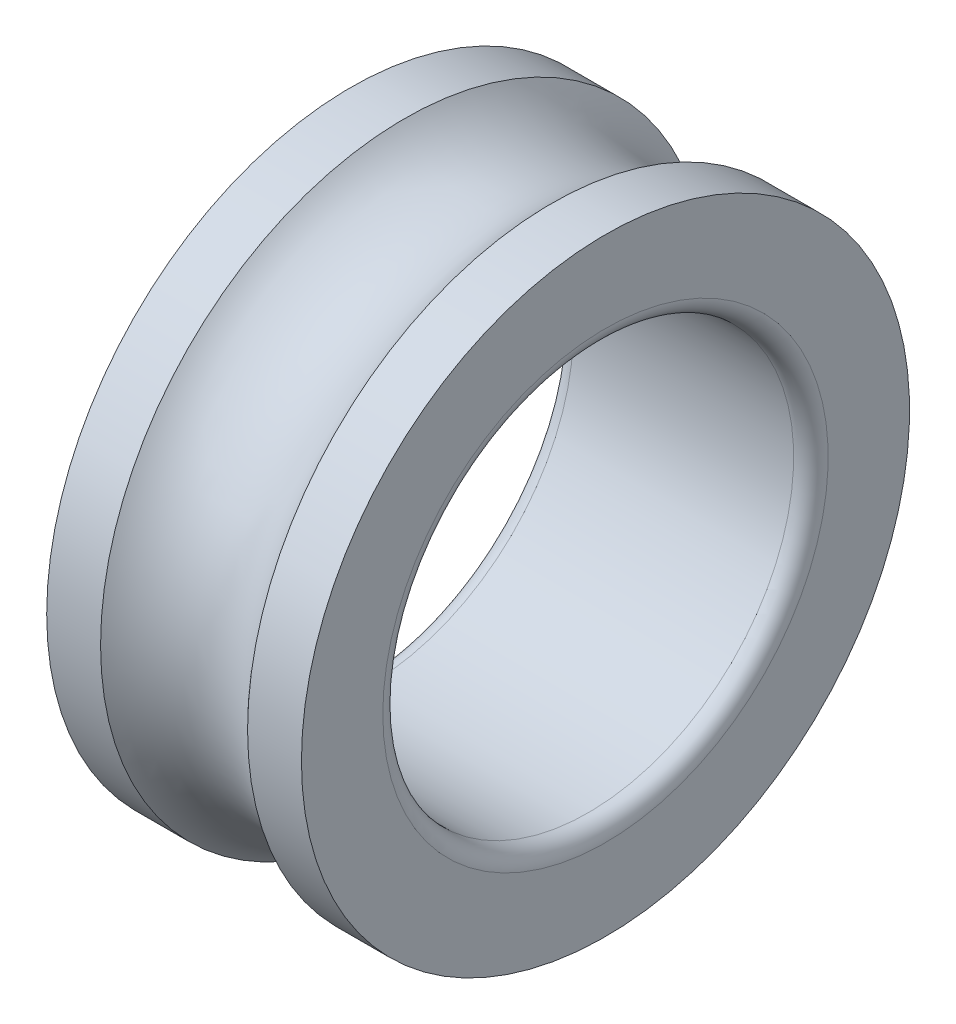
ISO-10303-21;
HEADER;
FILE_DESCRIPTION(('STEP AP214'),'2;1');
FILE_NAME('part.step','',(''),(''),'','','');
FILE_SCHEMA(('AUTOMOTIVE_DESIGN { 1 0 10303 214 1 1 1 1 }'));
ENDSEC;
DATA;
#1=APPLICATION_CONTEXT('core data for automotive mechanical design processes');
#2=APPLICATION_PROTOCOL_DEFINITION('international standard','automotive_design',2000,#1);
#3=PRODUCT_CONTEXT('',#1,'mechanical');
#4=PRODUCT('Part','Part','',(#3));
#5=PRODUCT_RELATED_PRODUCT_CATEGORY('part','',(#4));
#6=PRODUCT_DEFINITION_FORMATION('','',#4);
#7=PRODUCT_DEFINITION_CONTEXT('part definition',#1,'design');
#8=PRODUCT_DEFINITION('design','',#6,#7);
#9=PRODUCT_DEFINITION_SHAPE('','',#8);
#10=(LENGTH_UNIT() NAMED_UNIT(*) SI_UNIT(.MILLI.,.METRE.));
#11=(NAMED_UNIT(*) PLANE_ANGLE_UNIT() SI_UNIT($,.RADIAN.));
#12=(NAMED_UNIT(*) SI_UNIT($,.STERADIAN.) SOLID_ANGLE_UNIT());
#13=UNCERTAINTY_MEASURE_WITH_UNIT(LENGTH_MEASURE(1.E-05),#10,'distance_accuracy_value','');
#14=(GEOMETRIC_REPRESENTATION_CONTEXT(3) GLOBAL_UNCERTAINTY_ASSIGNED_CONTEXT((#13)) GLOBAL_UNIT_ASSIGNED_CONTEXT((#10,
#11,#12)) REPRESENTATION_CONTEXT('',''));
#15=CARTESIAN_POINT('',(0.,0.,0.));
#16=DIRECTION('',(0.,0.,1.));
#17=DIRECTION('',(1.,0.,0.));
#18=AXIS2_PLACEMENT_3D('',#15,#16,#17);
#19=CARTESIAN_POINT('',(-11.8693693693694,0.,0.));
#20=DIRECTION('',(-1.,0.,0.));
#21=DIRECTION('',(0.,0.,1.));
#22=AXIS2_PLACEMENT_3D('',#19,#20,#21);
#23=CYLINDRICAL_SURFACE('',#22,37.);
#24=CARTESIAN_POINT('',(-15.5,0.,0.));
#25=DIRECTION('',(-1.,0.,0.));
#26=DIRECTION('',(0.,0.,1.));
#27=AXIS2_PLACEMENT_3D('',#24,#25,#26);
#28=CIRCLE('',#27,37.);
#29=CARTESIAN_POINT('',(-15.5,0.,37.));
#30=VERTEX_POINT('',#29);
#31=EDGE_CURVE('E10',#30,#30,#28,.T.);
#32=ORIENTED_EDGE('',*,*,#31,.F.);
#33=EDGE_LOOP('',(#32));
#34=FACE_BOUND('',#33,.T.);
#35=CARTESIAN_POINT('',(-8.94427190999915,0.,0.));
#36=DIRECTION('',(-1.,0.,0.));
#37=DIRECTION('',(0.,0.,1.));
#38=AXIS2_PLACEMENT_3D('',#35,#36,#37);
#39=CIRCLE('',#38,37.);
#40=CARTESIAN_POINT('',(-8.94427190999915,0.,37.));
#41=VERTEX_POINT('',#40);
#42=EDGE_CURVE('E71',#41,#41,#39,.T.);
#43=ORIENTED_EDGE('',*,*,#42,.T.);
#44=EDGE_LOOP('',(#43));
#45=FACE_BOUND('',#44,.T.);
#46=ADVANCED_FACE('F36',(#34,#45),#23,.T.);
#47=CARTESIAN_POINT('',(-15.5,37.,0.));
#48=DIRECTION('',(1.,0.,0.));
#49=DIRECTION('',(0.,0.,-1.));
#50=AXIS2_PLACEMENT_3D('',#47,#48,#49);
#51=PLANE('',#50);
#52=CARTESIAN_POINT('',(-15.5,0.,0.));
#53=DIRECTION('',(-1.,0.,0.));
#54=DIRECTION('',(0.,0.,1.));
#55=AXIS2_PLACEMENT_3D('',#52,#53,#54);
#56=CIRCLE('',#55,27.1);
#57=CARTESIAN_POINT('',(-15.5,0.,27.1));
#58=VERTEX_POINT('',#57);
#59=EDGE_CURVE('E43',#58,#58,#56,.T.);
#60=ORIENTED_EDGE('',*,*,#59,.F.);
#61=EDGE_LOOP('',(#60));
#62=FACE_BOUND('',#61,.T.);
#63=ORIENTED_EDGE('',*,*,#31,.T.);
#64=EDGE_LOOP('',(#63));
#65=FACE_BOUND('',#64,.T.);
#66=ADVANCED_FACE('F109',(#62,#65),#51,.F.);
#67=CARTESIAN_POINT('',(-13.4,0.,0.));
#68=DIRECTION('',(-1.,0.,0.));
#69=DIRECTION('',(0.,0.,1.));
#70=AXIS2_PLACEMENT_3D('',#67,#68,#69);
#71=TOROIDAL_SURFACE('',#70,27.1,2.1);
#72=CARTESIAN_POINT('',(-13.4,0.,0.));
#73=DIRECTION('',(-1.,0.,0.));
#74=DIRECTION('',(0.,0.,1.));
#75=AXIS2_PLACEMENT_3D('',#72,#73,#74);
#76=CIRCLE('',#75,25.);
#77=CARTESIAN_POINT('',(-13.4,0.,25.));
#78=VERTEX_POINT('',#77);
#79=EDGE_CURVE('E48',#78,#78,#76,.T.);
#80=ORIENTED_EDGE('',*,*,#79,.F.);
#81=EDGE_LOOP('',(#80));
#82=FACE_BOUND('',#81,.T.);
#83=ORIENTED_EDGE('',*,*,#59,.T.);
#84=EDGE_LOOP('',(#83));
#85=FACE_BOUND('',#84,.T.);
#86=ADVANCED_FACE('F104',(#82,#85),#71,.T.);
#87=CARTESIAN_POINT('',(-11.8693693693694,0.,0.));
#88=DIRECTION('',(-1.,0.,0.));
#89=DIRECTION('',(0.,0.,1.));
#90=AXIS2_PLACEMENT_3D('',#87,#88,#89);
#91=CYLINDRICAL_SURFACE('',#90,25.);
#92=CARTESIAN_POINT('',(13.4,0.,0.));
#93=DIRECTION('',(-1.,0.,0.));
#94=DIRECTION('',(0.,0.,1.));
#95=AXIS2_PLACEMENT_3D('',#92,#93,#94);
#96=CIRCLE('',#95,25.);
#97=CARTESIAN_POINT('',(13.4,0.,25.));
#98=VERTEX_POINT('',#97);
#99=EDGE_CURVE('E53',#98,#98,#96,.T.);
#100=ORIENTED_EDGE('',*,*,#99,.F.);
#101=EDGE_LOOP('',(#100));
#102=FACE_BOUND('',#101,.T.);
#103=ORIENTED_EDGE('',*,*,#79,.T.);
#104=EDGE_LOOP('',(#103));
#105=FACE_BOUND('',#104,.T.);
#106=ADVANCED_FACE('F98',(#102,#105),#91,.F.);
#107=CARTESIAN_POINT('',(13.4,0.,0.));
#108=DIRECTION('',(-1.,0.,0.));
#109=DIRECTION('',(0.,0.,1.));
#110=AXIS2_PLACEMENT_3D('',#107,#108,#109);
#111=TOROIDAL_SURFACE('',#110,27.1,2.1);
#112=CARTESIAN_POINT('',(15.5,0.,0.));
#113=DIRECTION('',(-1.,0.,0.));
#114=DIRECTION('',(0.,0.,1.));
#115=AXIS2_PLACEMENT_3D('',#112,#113,#114);
#116=CIRCLE('',#115,27.1);
#117=CARTESIAN_POINT('',(15.5,0.,27.1));
#118=VERTEX_POINT('',#117);
#119=EDGE_CURVE('E59',#118,#118,#116,.T.);
#120=ORIENTED_EDGE('',*,*,#119,.F.);
#121=EDGE_LOOP('',(#120));
#122=FACE_BOUND('',#121,.T.);
#123=ORIENTED_EDGE('',*,*,#99,.T.);
#124=EDGE_LOOP('',(#123));
#125=FACE_BOUND('',#124,.T.);
#126=ADVANCED_FACE('F92',(#122,#125),#111,.T.);
#127=CARTESIAN_POINT('',(15.5,37.,0.));
#128=DIRECTION('',(-1.,0.,0.));
#129=DIRECTION('',(0.,0.,1.));
#130=AXIS2_PLACEMENT_3D('',#127,#128,#129);
#131=PLANE('',#130);
#132=CARTESIAN_POINT('',(15.5,0.,0.));
#133=DIRECTION('',(-1.,0.,0.));
#134=DIRECTION('',(0.,0.,1.));
#135=AXIS2_PLACEMENT_3D('',#132,#133,#134);
#136=CIRCLE('',#135,37.);
#137=CARTESIAN_POINT('',(15.5,0.,37.));
#138=VERTEX_POINT('',#137);
#139=EDGE_CURVE('E63',#138,#138,#136,.T.);
#140=ORIENTED_EDGE('',*,*,#139,.F.);
#141=EDGE_LOOP('',(#140));
#142=FACE_BOUND('',#141,.T.);
#143=ORIENTED_EDGE('',*,*,#119,.T.);
#144=EDGE_LOOP('',(#143));
#145=FACE_BOUND('',#144,.T.);
#146=ADVANCED_FACE('F86',(#142,#145),#131,.F.);
#147=CARTESIAN_POINT('',(-11.8693693693694,0.,0.));
#148=DIRECTION('',(-1.,0.,0.));
#149=DIRECTION('',(0.,0.,1.));
#150=AXIS2_PLACEMENT_3D('',#147,#148,#149);
#151=CYLINDRICAL_SURFACE('',#150,37.);
#152=CARTESIAN_POINT('',(8.94427190999917,0.,0.));
#153=DIRECTION('',(-1.,0.,0.));
#154=DIRECTION('',(0.,0.,1.));
#155=AXIS2_PLACEMENT_3D('',#152,#153,#154);
#156=CIRCLE('',#155,37.);
#157=CARTESIAN_POINT('',(8.94427190999917,0.,37.));
#158=VERTEX_POINT('',#157);
#159=EDGE_CURVE('E67',#158,#158,#156,.T.);
#160=ORIENTED_EDGE('',*,*,#159,.F.);
#161=EDGE_LOOP('',(#160));
#162=FACE_BOUND('',#161,.T.);
#163=ORIENTED_EDGE('',*,*,#139,.T.);
#164=EDGE_LOOP('',(#163));
#165=FACE_BOUND('',#164,.T.);
#166=ADVANCED_FACE('F80',(#162,#165),#151,.T.);
#167=CARTESIAN_POINT('',(0.,0.,0.));
#168=DIRECTION('',(-1.,0.,0.));
#169=DIRECTION('',(0.,0.,1.));
#170=AXIS2_PLACEMENT_3D('',#167,#168,#169);
#171=TOROIDAL_SURFACE('',#170,45.,12.);
#172=ORIENTED_EDGE('',*,*,#42,.F.);
#173=EDGE_LOOP('',(#172));
#174=FACE_BOUND('',#173,.T.);
#175=ORIENTED_EDGE('',*,*,#159,.T.);
#176=EDGE_LOOP('',(#175));
#177=FACE_BOUND('',#176,.T.);
#178=ADVANCED_FACE('F77',(#174,#177),#171,.F.);
#179=CLOSED_SHELL('',(#46,#66,#86,#106,#126,#146,#166,#178));
#180=MANIFOLD_SOLID_BREP('B2',#179);
#181=ADVANCED_BREP_SHAPE_REPRESENTATION('',(#18,#180),#14);
#182=SHAPE_DEFINITION_REPRESENTATION(#9,#181);
ENDSEC;
END-ISO-10303-21;
